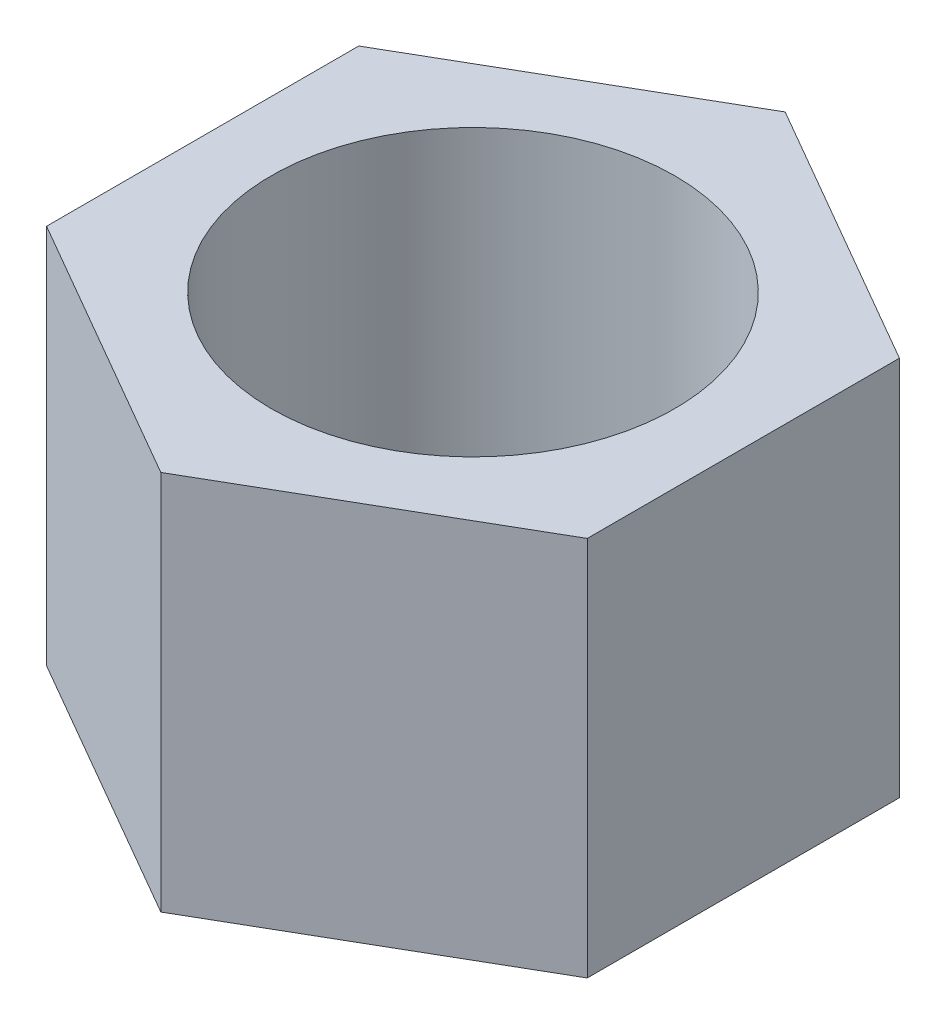
ISO-10303-21;
HEADER;
FILE_DESCRIPTION(('STEP AP214'),'2;1');
FILE_NAME('part.step','',(''),(''),'','','');
FILE_SCHEMA(('AUTOMOTIVE_DESIGN { 1 0 10303 214 1 1 1 1 }'));
ENDSEC;
DATA;
#1=APPLICATION_CONTEXT('core data for automotive mechanical design processes');
#2=APPLICATION_PROTOCOL_DEFINITION('international standard','automotive_design',2000,#1);
#3=PRODUCT_CONTEXT('',#1,'mechanical');
#4=PRODUCT('Part','Part','',(#3));
#5=PRODUCT_RELATED_PRODUCT_CATEGORY('part','',(#4));
#6=PRODUCT_DEFINITION_FORMATION('','',#4);
#7=PRODUCT_DEFINITION_CONTEXT('part definition',#1,'design');
#8=PRODUCT_DEFINITION('design','',#6,#7);
#9=PRODUCT_DEFINITION_SHAPE('','',#8);
#10=(LENGTH_UNIT() NAMED_UNIT(*) SI_UNIT(.MILLI.,.METRE.));
#11=(NAMED_UNIT(*) PLANE_ANGLE_UNIT() SI_UNIT($,.RADIAN.));
#12=(NAMED_UNIT(*) SI_UNIT($,.STERADIAN.) SOLID_ANGLE_UNIT());
#13=UNCERTAINTY_MEASURE_WITH_UNIT(LENGTH_MEASURE(1.E-05),#10,'distance_accuracy_value','');
#14=(GEOMETRIC_REPRESENTATION_CONTEXT(3) GLOBAL_UNCERTAINTY_ASSIGNED_CONTEXT((#13)) GLOBAL_UNIT_ASSIGNED_CONTEXT((#10,
#11,#12)) REPRESENTATION_CONTEXT('',''));
#15=CARTESIAN_POINT('',(0.,0.,0.));
#16=DIRECTION('',(0.,0.,1.));
#17=DIRECTION('',(1.,0.,0.));
#18=AXIS2_PLACEMENT_3D('',#15,#16,#17);
#19=CARTESIAN_POINT('',(0.,5.,0.));
#20=DIRECTION('',(0.,-1.,0.));
#21=DIRECTION('',(0.,0.,-1.));
#22=AXIS2_PLACEMENT_3D('',#19,#20,#21);
#23=PLANE('',#22);
#24=DIRECTION('',(0.,0.,1.));
#25=VECTOR('',#24,1.);
#26=CARTESIAN_POINT('',(-3.5507041555162,5.,2.05));
#27=LINE('',#26,#25);
#28=CARTESIAN_POINT('',(-3.5507041555162,5.,-2.05));
#29=VERTEX_POINT('',#28);
#30=CARTESIAN_POINT('',(-3.5507041555162,5.,2.05));
#31=VERTEX_POINT('',#30);
#32=EDGE_CURVE('E131',#29,#31,#27,.T.);
#33=ORIENTED_EDGE('',*,*,#32,.T.);
#34=DIRECTION('',(0.866025403784439,0.,0.5));
#35=VECTOR('',#34,1.);
#36=CARTESIAN_POINT('',(0.,5.,4.1));
#37=LINE('',#36,#35);
#38=CARTESIAN_POINT('',(0.,5.,4.1));
#39=VERTEX_POINT('',#38);
#40=EDGE_CURVE('E89',#31,#39,#37,.T.);
#41=ORIENTED_EDGE('',*,*,#40,.T.);
#42=DIRECTION('',(0.866025403784439,0.,-0.5));
#43=VECTOR('',#42,1.);
#44=CARTESIAN_POINT('',(3.5507041555162,5.,2.05));
#45=LINE('',#44,#43);
#46=CARTESIAN_POINT('',(3.5507041555162,5.,2.05));
#47=VERTEX_POINT('',#46);
#48=EDGE_CURVE('E102',#39,#47,#45,.T.);
#49=ORIENTED_EDGE('',*,*,#48,.T.);
#50=DIRECTION('',(0.,0.,-1.));
#51=VECTOR('',#50,1.);
#52=CARTESIAN_POINT('',(3.5507041555162,5.,-2.05));
#53=LINE('',#52,#51);
#54=CARTESIAN_POINT('',(3.5507041555162,5.,-2.05));
#55=VERTEX_POINT('',#54);
#56=EDGE_CURVE('E96',#47,#55,#53,.T.);
#57=ORIENTED_EDGE('',*,*,#56,.T.);
#58=DIRECTION('',(-0.866025403784439,0.,-0.5));
#59=VECTOR('',#58,1.);
#60=CARTESIAN_POINT('',(0.,5.,-4.1));
#61=LINE('',#60,#59);
#62=CARTESIAN_POINT('',(0.,5.,-4.1));
#63=VERTEX_POINT('',#62);
#64=EDGE_CURVE('E100',#55,#63,#61,.T.);
#65=ORIENTED_EDGE('',*,*,#64,.T.);
#66=DIRECTION('',(-0.866025403784439,0.,0.5));
#67=VECTOR('',#66,1.);
#68=CARTESIAN_POINT('',(-3.5507041555162,5.,-2.05));
#69=LINE('',#68,#67);
#70=EDGE_CURVE('E52',#63,#29,#69,.T.);
#71=ORIENTED_EDGE('',*,*,#70,.T.);
#72=EDGE_LOOP('',(#33,#41,#49,#57,#65,#71));
#73=FACE_BOUND('',#72,.T.);
#74=CARTESIAN_POINT('',(0.,5.,0.));
#75=DIRECTION('',(0.,1.,0.));
#76=DIRECTION('',(0.,0.,1.));
#77=AXIS2_PLACEMENT_3D('',#74,#75,#76);
#78=CIRCLE('',#77,2.65);
#79=CARTESIAN_POINT('',(0.,5.,2.65));
#80=VERTEX_POINT('',#79);
#81=EDGE_CURVE('E124',#80,#80,#78,.T.);
#82=ORIENTED_EDGE('',*,*,#81,.F.);
#83=EDGE_LOOP('',(#82));
#84=FACE_BOUND('',#83,.T.);
#85=ADVANCED_FACE('F35',(#73,#84),#23,.F.);
#86=CARTESIAN_POINT('',(0.,0.,0.));
#87=DIRECTION('',(0.,-1.,0.));
#88=DIRECTION('',(0.,0.,-1.));
#89=AXIS2_PLACEMENT_3D('',#86,#87,#88);
#90=PLANE('',#89);
#91=DIRECTION('',(0.,0.,1.));
#92=VECTOR('',#91,1.);
#93=CARTESIAN_POINT('',(-3.5507041555162,0.,2.05));
#94=LINE('',#93,#92);
#95=CARTESIAN_POINT('',(-3.5507041555162,0.,-2.05));
#96=VERTEX_POINT('',#95);
#97=CARTESIAN_POINT('',(-3.5507041555162,0.,2.05));
#98=VERTEX_POINT('',#97);
#99=EDGE_CURVE('E120',#96,#98,#94,.T.);
#100=ORIENTED_EDGE('',*,*,#99,.F.);
#101=DIRECTION('',(-0.866025403784439,0.,0.5));
#102=VECTOR('',#101,1.);
#103=CARTESIAN_POINT('',(-3.5507041555162,0.,-2.05));
#104=LINE('',#103,#102);
#105=CARTESIAN_POINT('',(0.,0.,-4.1));
#106=VERTEX_POINT('',#105);
#107=EDGE_CURVE('E81',#106,#96,#104,.T.);
#108=ORIENTED_EDGE('',*,*,#107,.F.);
#109=DIRECTION('',(-0.866025403784439,0.,-0.5));
#110=VECTOR('',#109,1.);
#111=CARTESIAN_POINT('',(0.,0.,-4.1));
#112=LINE('',#111,#110);
#113=CARTESIAN_POINT('',(3.5507041555162,0.,-2.05));
#114=VERTEX_POINT('',#113);
#115=EDGE_CURVE('E75',#114,#106,#112,.T.);
#116=ORIENTED_EDGE('',*,*,#115,.F.);
#117=DIRECTION('',(0.,0.,-1.));
#118=VECTOR('',#117,1.);
#119=CARTESIAN_POINT('',(3.5507041555162,0.,-2.05));
#120=LINE('',#119,#118);
#121=CARTESIAN_POINT('',(3.5507041555162,0.,2.05));
#122=VERTEX_POINT('',#121);
#123=EDGE_CURVE('E110',#122,#114,#120,.T.);
#124=ORIENTED_EDGE('',*,*,#123,.F.);
#125=DIRECTION('',(0.866025403784439,0.,-0.5));
#126=VECTOR('',#125,1.);
#127=CARTESIAN_POINT('',(3.5507041555162,0.,2.05));
#128=LINE('',#127,#126);
#129=CARTESIAN_POINT('',(0.,0.,4.1));
#130=VERTEX_POINT('',#129);
#131=EDGE_CURVE('E126',#130,#122,#128,.T.);
#132=ORIENTED_EDGE('',*,*,#131,.F.);
#133=DIRECTION('',(0.866025403784439,0.,0.5));
#134=VECTOR('',#133,1.);
#135=CARTESIAN_POINT('',(0.,0.,4.1));
#136=LINE('',#135,#134);
#137=EDGE_CURVE('E123',#98,#130,#136,.T.);
#138=ORIENTED_EDGE('',*,*,#137,.F.);
#139=EDGE_LOOP('',(#100,#108,#116,#124,#132,#138));
#140=FACE_BOUND('',#139,.T.);
#141=CARTESIAN_POINT('',(0.,0.,0.));
#142=DIRECTION('',(0.,1.,0.));
#143=DIRECTION('',(0.,0.,1.));
#144=AXIS2_PLACEMENT_3D('',#141,#142,#143);
#145=CIRCLE('',#144,2.65);
#146=CARTESIAN_POINT('',(0.,0.,2.65));
#147=VERTEX_POINT('',#146);
#148=EDGE_CURVE('E224',#147,#147,#145,.T.);
#149=ORIENTED_EDGE('',*,*,#148,.T.);
#150=EDGE_LOOP('',(#149));
#151=FACE_BOUND('',#150,.T.);
#152=ADVANCED_FACE('F140',(#140,#151),#90,.T.);
#153=CARTESIAN_POINT('',(-3.5507041555162,5.,2.05));
#154=DIRECTION('',(1.,0.,0.));
#155=DIRECTION('',(0.,0.,-1.));
#156=AXIS2_PLACEMENT_3D('',#153,#154,#155);
#157=PLANE('',#156);
#158=ORIENTED_EDGE('',*,*,#99,.T.);
#159=DIRECTION('',(0.,-1.,0.));
#160=VECTOR('',#159,1.);
#161=CARTESIAN_POINT('',(-3.5507041555162,5.,2.05));
#162=LINE('',#161,#160);
#163=EDGE_CURVE('E11',#31,#98,#162,.T.);
#164=ORIENTED_EDGE('',*,*,#163,.F.);
#165=ORIENTED_EDGE('',*,*,#32,.F.);
#166=DIRECTION('',(0.,-1.,0.));
#167=VECTOR('',#166,1.);
#168=CARTESIAN_POINT('',(-3.5507041555162,5.,-2.05));
#169=LINE('',#168,#167);
#170=EDGE_CURVE('E116',#29,#96,#169,.T.);
#171=ORIENTED_EDGE('',*,*,#170,.T.);
#172=EDGE_LOOP('',(#158,#164,#165,#171));
#173=FACE_BOUND('',#172,.T.);
#174=ADVANCED_FACE('F37',(#173),#157,.F.);
#175=CARTESIAN_POINT('',(0.,5.,4.1));
#176=DIRECTION('',(0.5,0.,-0.866025403784439));
#177=DIRECTION('',(-0.866025403784439,0.,-0.5));
#178=AXIS2_PLACEMENT_3D('',#175,#176,#177);
#179=PLANE('',#178);
#180=ORIENTED_EDGE('',*,*,#137,.T.);
#181=DIRECTION('',(0.,-1.,0.));
#182=VECTOR('',#181,1.);
#183=CARTESIAN_POINT('',(0.,5.,4.1));
#184=LINE('',#183,#182);
#185=EDGE_CURVE('E44',#39,#130,#184,.T.);
#186=ORIENTED_EDGE('',*,*,#185,.F.);
#187=ORIENTED_EDGE('',*,*,#40,.F.);
#188=ORIENTED_EDGE('',*,*,#163,.T.);
#189=EDGE_LOOP('',(#180,#186,#187,#188));
#190=FACE_BOUND('',#189,.T.);
#191=ADVANCED_FACE('F165',(#190),#179,.F.);
#192=CARTESIAN_POINT('',(3.5507041555162,5.,2.05));
#193=DIRECTION('',(-0.5,0.,-0.866025403784439));
#194=DIRECTION('',(-0.866025403784439,0.,0.5));
#195=AXIS2_PLACEMENT_3D('',#192,#193,#194);
#196=PLANE('',#195);
#197=ORIENTED_EDGE('',*,*,#131,.T.);
#198=DIRECTION('',(0.,-1.,0.));
#199=VECTOR('',#198,1.);
#200=CARTESIAN_POINT('',(3.5507041555162,5.,2.05));
#201=LINE('',#200,#199);
#202=EDGE_CURVE('E111',#47,#122,#201,.T.);
#203=ORIENTED_EDGE('',*,*,#202,.F.);
#204=ORIENTED_EDGE('',*,*,#48,.F.);
#205=ORIENTED_EDGE('',*,*,#185,.T.);
#206=EDGE_LOOP('',(#197,#203,#204,#205));
#207=FACE_BOUND('',#206,.T.);
#208=ADVANCED_FACE('F137',(#207),#196,.F.);
#209=CARTESIAN_POINT('',(3.5507041555162,5.,-2.05));
#210=DIRECTION('',(-1.,0.,0.));
#211=DIRECTION('',(0.,0.,1.));
#212=AXIS2_PLACEMENT_3D('',#209,#210,#211);
#213=PLANE('',#212);
#214=ORIENTED_EDGE('',*,*,#123,.T.);
#215=DIRECTION('',(0.,-1.,0.));
#216=VECTOR('',#215,1.);
#217=CARTESIAN_POINT('',(3.5507041555162,5.,-2.05));
#218=LINE('',#217,#216);
#219=EDGE_CURVE('E107',#55,#114,#218,.T.);
#220=ORIENTED_EDGE('',*,*,#219,.F.);
#221=ORIENTED_EDGE('',*,*,#56,.F.);
#222=ORIENTED_EDGE('',*,*,#202,.T.);
#223=EDGE_LOOP('',(#214,#220,#221,#222));
#224=FACE_BOUND('',#223,.T.);
#225=ADVANCED_FACE('F108',(#224),#213,.F.);
#226=CARTESIAN_POINT('',(0.,5.,-4.1));
#227=DIRECTION('',(-0.5,0.,0.866025403784439));
#228=DIRECTION('',(0.866025403784439,0.,0.5));
#229=AXIS2_PLACEMENT_3D('',#226,#227,#228);
#230=PLANE('',#229);
#231=ORIENTED_EDGE('',*,*,#115,.T.);
#232=DIRECTION('',(0.,-1.,0.));
#233=VECTOR('',#232,1.);
#234=CARTESIAN_POINT('',(0.,5.,-4.1));
#235=LINE('',#234,#233);
#236=EDGE_CURVE('E112',#63,#106,#235,.T.);
#237=ORIENTED_EDGE('',*,*,#236,.F.);
#238=ORIENTED_EDGE('',*,*,#64,.F.);
#239=ORIENTED_EDGE('',*,*,#219,.T.);
#240=EDGE_LOOP('',(#231,#237,#238,#239));
#241=FACE_BOUND('',#240,.T.);
#242=ADVANCED_FACE('F114',(#241),#230,.F.);
#243=CARTESIAN_POINT('',(-3.5507041555162,5.,-2.05));
#244=DIRECTION('',(0.5,0.,0.866025403784439));
#245=DIRECTION('',(0.866025403784439,0.,-0.5));
#246=AXIS2_PLACEMENT_3D('',#243,#244,#245);
#247=PLANE('',#246);
#248=ORIENTED_EDGE('',*,*,#107,.T.);
#249=ORIENTED_EDGE('',*,*,#170,.F.);
#250=ORIENTED_EDGE('',*,*,#70,.F.);
#251=ORIENTED_EDGE('',*,*,#236,.T.);
#252=EDGE_LOOP('',(#248,#249,#250,#251));
#253=FACE_BOUND('',#252,.T.);
#254=ADVANCED_FACE('F145',(#253),#247,.F.);
#255=CARTESIAN_POINT('',(0.,5.,0.));
#256=DIRECTION('',(0.,-1.,0.));
#257=DIRECTION('',(0.,0.,-1.));
#258=AXIS2_PLACEMENT_3D('',#255,#256,#257);
#259=CYLINDRICAL_SURFACE('',#258,2.65);
#260=ORIENTED_EDGE('',*,*,#81,.T.);
#261=EDGE_LOOP('',(#260));
#262=FACE_BOUND('',#261,.T.);
#263=ORIENTED_EDGE('',*,*,#148,.F.);
#264=EDGE_LOOP('',(#263));
#265=FACE_BOUND('',#264,.T.);
#266=ADVANCED_FACE('F147',(#262,#265),#259,.F.);
#267=CLOSED_SHELL('',(#85,#152,#174,#191,#208,#225,#242,#254,#266));
#268=MANIFOLD_SOLID_BREP('B2',#267);
#269=ADVANCED_BREP_SHAPE_REPRESENTATION('',(#18,#268),#14);
#270=SHAPE_DEFINITION_REPRESENTATION(#9,#269);
ENDSEC;
END-ISO-10303-21;
